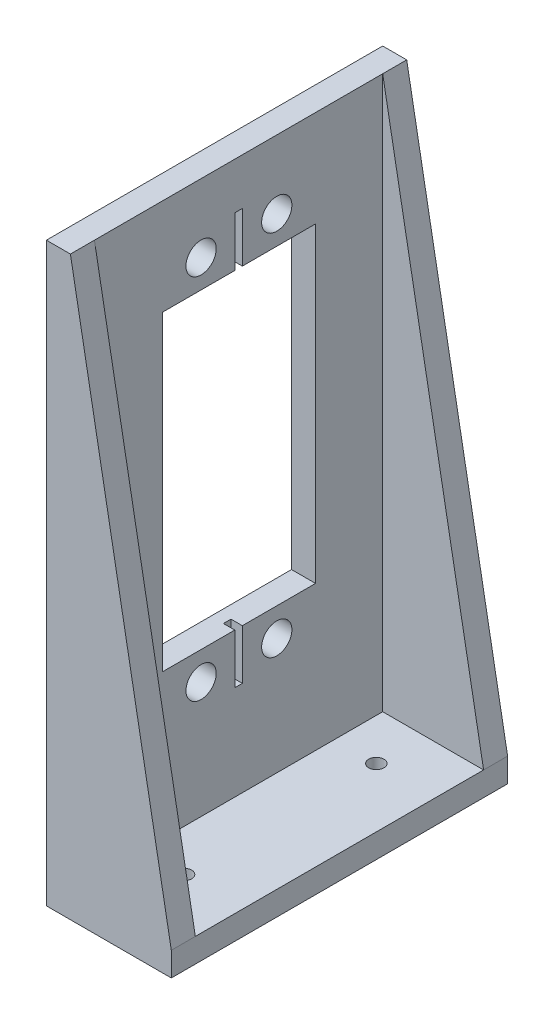
ISO-10303-21;
HEADER;
FILE_DESCRIPTION(('STEP AP214'),'2;1');
FILE_NAME('part.step','',(''),(''),'','','');
FILE_SCHEMA(('AUTOMOTIVE_DESIGN { 1 0 10303 214 1 1 1 1 }'));
ENDSEC;
DATA;
#1=APPLICATION_CONTEXT('core data for automotive mechanical design processes');
#2=APPLICATION_PROTOCOL_DEFINITION('international standard','automotive_design',2000,#1);
#3=PRODUCT_CONTEXT('',#1,'mechanical');
#4=PRODUCT('Part','Part','',(#3));
#5=PRODUCT_RELATED_PRODUCT_CATEGORY('part','',(#4));
#6=PRODUCT_DEFINITION_FORMATION('','',#4);
#7=PRODUCT_DEFINITION_CONTEXT('part definition',#1,'design');
#8=PRODUCT_DEFINITION('design','',#6,#7);
#9=PRODUCT_DEFINITION_SHAPE('','',#8);
#10=(LENGTH_UNIT() NAMED_UNIT(*) SI_UNIT(.MILLI.,.METRE.));
#11=(NAMED_UNIT(*) PLANE_ANGLE_UNIT() SI_UNIT($,.RADIAN.));
#12=(NAMED_UNIT(*) SI_UNIT($,.STERADIAN.) SOLID_ANGLE_UNIT());
#13=UNCERTAINTY_MEASURE_WITH_UNIT(LENGTH_MEASURE(1.E-05),#10,'distance_accuracy_value','');
#14=(GEOMETRIC_REPRESENTATION_CONTEXT(3) GLOBAL_UNCERTAINTY_ASSIGNED_CONTEXT((#13)) GLOBAL_UNIT_ASSIGNED_CONTEXT((#10,
#11,#12)) REPRESENTATION_CONTEXT('',''));
#15=CARTESIAN_POINT('',(0.,0.,0.));
#16=DIRECTION('',(0.,0.,1.));
#17=DIRECTION('',(1.,0.,0.));
#18=AXIS2_PLACEMENT_3D('',#15,#16,#17);
#19=CARTESIAN_POINT('',(3.175,3.175,22.225));
#20=DIRECTION('',(0.,-1.,0.));
#21=DIRECTION('',(1.,0.,0.));
#22=AXIS2_PLACEMENT_3D('',#19,#20,#21);
#23=PLANE('',#22);
#24=CARTESIAN_POINT('',(8.67999991199999,3.175,-12.7));
#25=DIRECTION('',(0.,1.,0.));
#26=DIRECTION('',(-1.,0.,0.));
#27=AXIS2_PLACEMENT_3D('',#24,#25,#26);
#28=CIRCLE('',#27,1.000000032);
#29=CARTESIAN_POINT('',(7.67999987999999,3.175,-12.7));
#30=VERTEX_POINT('',#29);
#31=EDGE_CURVE('E306',#30,#30,#28,.T.);
#32=ORIENTED_EDGE('',*,*,#31,.F.);
#33=EDGE_LOOP('',(#32));
#34=FACE_BOUND('',#33,.T.);
#35=CARTESIAN_POINT('',(8.67999991199999,3.175,12.7));
#36=DIRECTION('',(0.,1.,0.));
#37=DIRECTION('',(1.,0.,0.));
#38=AXIS2_PLACEMENT_3D('',#35,#36,#37);
#39=CIRCLE('',#38,1.000000032);
#40=CARTESIAN_POINT('',(9.679999944,3.175,12.7));
#41=VERTEX_POINT('',#40);
#42=EDGE_CURVE('E309',#41,#41,#39,.T.);
#43=ORIENTED_EDGE('',*,*,#42,.F.);
#44=EDGE_LOOP('',(#43));
#45=FACE_BOUND('',#44,.T.);
#46=DIRECTION('',(1.,0.,0.));
#47=VECTOR('',#46,1.);
#48=CARTESIAN_POINT('',(16.51,3.175,-19.05));
#49=LINE('',#48,#47);
#50=CARTESIAN_POINT('',(3.175,3.175,-19.05));
#51=VERTEX_POINT('',#50);
#52=CARTESIAN_POINT('',(16.51,3.175,-19.05));
#53=VERTEX_POINT('',#52);
#54=EDGE_CURVE('E320',#51,#53,#49,.T.);
#55=ORIENTED_EDGE('',*,*,#54,.F.);
#56=DIRECTION('',(0.,0.,-1.));
#57=VECTOR('',#56,1.);
#58=CARTESIAN_POINT('',(3.175,3.175,22.225));
#59=LINE('',#58,#57);
#60=CARTESIAN_POINT('',(3.175,3.175,19.05));
#61=VERTEX_POINT('',#60);
#62=EDGE_CURVE('E371',#61,#51,#59,.T.);
#63=ORIENTED_EDGE('',*,*,#62,.F.);
#64=DIRECTION('',(1.,0.,0.));
#65=VECTOR('',#64,1.);
#66=CARTESIAN_POINT('',(16.51,3.175,19.05));
#67=LINE('',#66,#65);
#68=CARTESIAN_POINT('',(16.51,3.175,19.05));
#69=VERTEX_POINT('',#68);
#70=EDGE_CURVE('E334',#61,#69,#67,.T.);
#71=ORIENTED_EDGE('',*,*,#70,.T.);
#72=DIRECTION('',(0.,0.,-1.));
#73=VECTOR('',#72,1.);
#74=CARTESIAN_POINT('',(16.51,3.175,22.225));
#75=LINE('',#74,#73);
#76=EDGE_CURVE('E373',#69,#53,#75,.T.);
#77=ORIENTED_EDGE('',*,*,#76,.T.);
#78=EDGE_LOOP('',(#55,#63,#71,#77));
#79=FACE_BOUND('',#78,.T.);
#80=ADVANCED_FACE('F37',(#34,#45,#79),#23,.F.);
#81=CARTESIAN_POINT('',(3.175,76.2,22.225));
#82=DIRECTION('',(-1.,0.,0.));
#83=DIRECTION('',(0.,-1.,0.));
#84=AXIS2_PLACEMENT_3D('',#81,#82,#83);
#85=PLANE('',#84);
#86=DIRECTION('',(0.,0.,-1.));
#87=VECTOR('',#86,1.);
#88=CARTESIAN_POINT('',(3.175,15.693999981,10.079999906));
#89=LINE('',#88,#87);
#90=CARTESIAN_POINT('',(3.175,15.693999981,0.500000016));
#91=VERTEX_POINT('',#90);
#92=CARTESIAN_POINT('',(3.175,15.693999981,-0.500000016));
#93=VERTEX_POINT('',#92);
#94=EDGE_CURVE('E193',#91,#93,#89,.T.);
#95=ORIENTED_EDGE('',*,*,#94,.F.);
#96=DIRECTION('',(0.,1.,0.));
#97=VECTOR('',#96,1.);
#98=CARTESIAN_POINT('',(3.175,15.693999981,0.500000016));
#99=LINE('',#98,#97);
#100=CARTESIAN_POINT('',(3.175,22.297999981,0.500000016));
#101=VERTEX_POINT('',#100);
#102=EDGE_CURVE('E176',#91,#101,#99,.T.);
#103=ORIENTED_EDGE('',*,*,#102,.T.);
#104=DIRECTION('',(0.,0.,-1.));
#105=VECTOR('',#104,1.);
#106=CARTESIAN_POINT('',(3.175,22.297999981,10.079999906));
#107=LINE('',#106,#105);
#108=CARTESIAN_POINT('',(3.175,22.297999981,10.079999906));
#109=VERTEX_POINT('',#108);
#110=EDGE_CURVE('E259',#109,#101,#107,.T.);
#111=ORIENTED_EDGE('',*,*,#110,.F.);
#112=DIRECTION('',(0.,-1.,0.));
#113=VECTOR('',#112,1.);
#114=CARTESIAN_POINT('',(3.175,63.451999969,10.079999906));
#115=LINE('',#114,#113);
#116=CARTESIAN_POINT('',(3.175,63.451999969,10.079999906));
#117=VERTEX_POINT('',#116);
#118=EDGE_CURVE('E237',#117,#109,#115,.T.);
#119=ORIENTED_EDGE('',*,*,#118,.F.);
#120=DIRECTION('',(0.,0.,1.));
#121=VECTOR('',#120,1.);
#122=CARTESIAN_POINT('',(3.175,63.451999969,10.079999906));
#123=LINE('',#122,#121);
#124=CARTESIAN_POINT('',(3.175,63.451999969,0.500000016));
#125=VERTEX_POINT('',#124);
#126=EDGE_CURVE('E264',#125,#117,#123,.T.);
#127=ORIENTED_EDGE('',*,*,#126,.F.);
#128=DIRECTION('',(0.,-1.,0.));
#129=VECTOR('',#128,1.);
#130=CARTESIAN_POINT('',(3.175,70.055999969,0.500000016));
#131=LINE('',#130,#129);
#132=CARTESIAN_POINT('',(3.175,70.055999969,0.500000016));
#133=VERTEX_POINT('',#132);
#134=EDGE_CURVE('E60',#133,#125,#131,.T.);
#135=ORIENTED_EDGE('',*,*,#134,.F.);
#136=DIRECTION('',(0.,0.,1.));
#137=VECTOR('',#136,1.);
#138=CARTESIAN_POINT('',(3.175,70.055999969,-0.500000016));
#139=LINE('',#138,#137);
#140=CARTESIAN_POINT('',(3.175,70.055999969,-0.500000016));
#141=VERTEX_POINT('',#140);
#142=EDGE_CURVE('E216',#141,#133,#139,.T.);
#143=ORIENTED_EDGE('',*,*,#142,.F.);
#144=DIRECTION('',(0.,-1.,0.));
#145=VECTOR('',#144,1.);
#146=CARTESIAN_POINT('',(3.175,70.055999969,-0.500000016));
#147=LINE('',#146,#145);
#148=CARTESIAN_POINT('',(3.175,63.451999969,-0.500000016));
#149=VERTEX_POINT('',#148);
#150=EDGE_CURVE('E234',#141,#149,#147,.T.);
#151=ORIENTED_EDGE('',*,*,#150,.T.);
#152=CARTESIAN_POINT('',(3.175,63.451999969,-10.173999972));
#153=VERTEX_POINT('',#152);
#154=EDGE_CURVE('E247',#153,#149,#123,.T.);
#155=ORIENTED_EDGE('',*,*,#154,.F.);
#156=DIRECTION('',(0.,1.,0.));
#157=VECTOR('',#156,1.);
#158=CARTESIAN_POINT('',(3.175,63.451999969,-10.173999972));
#159=LINE('',#158,#157);
#160=CARTESIAN_POINT('',(3.175,22.297999981,-10.173999972));
#161=VERTEX_POINT('',#160);
#162=EDGE_CURVE('E261',#161,#153,#159,.T.);
#163=ORIENTED_EDGE('',*,*,#162,.F.);
#164=CARTESIAN_POINT('',(3.175,22.297999981,-0.500000016));
#165=VERTEX_POINT('',#164);
#166=EDGE_CURVE('E258',#165,#161,#107,.T.);
#167=ORIENTED_EDGE('',*,*,#166,.F.);
#168=DIRECTION('',(0.,1.,0.));
#169=VECTOR('',#168,1.);
#170=CARTESIAN_POINT('',(3.175,15.693999981,-0.500000016));
#171=LINE('',#170,#169);
#172=EDGE_CURVE('E52',#93,#165,#171,.T.);
#173=ORIENTED_EDGE('',*,*,#172,.F.);
#174=EDGE_LOOP('',(#95,#103,#111,#119,#127,#135,#143,#151,#155,#163,#167,#173));
#175=FACE_BOUND('',#174,.T.);
#176=CARTESIAN_POINT('',(3.175,18.574999934,-5.047000066));
#177=DIRECTION('',(1.,0.,0.));
#178=DIRECTION('',(0.,1.,0.));
#179=AXIS2_PLACEMENT_3D('',#176,#177,#178);
#180=CIRCLE('',#179,2.000000064);
#181=CARTESIAN_POINT('',(3.175,20.574999998,-5.047000066));
#182=VERTEX_POINT('',#181);
#183=EDGE_CURVE('E284',#182,#182,#180,.T.);
#184=ORIENTED_EDGE('',*,*,#183,.F.);
#185=EDGE_LOOP('',(#184));
#186=FACE_BOUND('',#185,.T.);
#187=CARTESIAN_POINT('',(3.175,67.175000016,4.953));
#188=DIRECTION('',(1.,0.,0.));
#189=DIRECTION('',(0.,1.,0.));
#190=AXIS2_PLACEMENT_3D('',#187,#188,#189);
#191=CIRCLE('',#190,2.000000064);
#192=CARTESIAN_POINT('',(3.175,69.17500008,4.953));
#193=VERTEX_POINT('',#192);
#194=EDGE_CURVE('E291',#193,#193,#191,.T.);
#195=ORIENTED_EDGE('',*,*,#194,.F.);
#196=EDGE_LOOP('',(#195));
#197=FACE_BOUND('',#196,.T.);
#198=CARTESIAN_POINT('',(3.175,67.175000016,-5.047000066));
#199=DIRECTION('',(1.,0.,0.));
#200=DIRECTION('',(0.,1.,0.));
#201=AXIS2_PLACEMENT_3D('',#198,#199,#200);
#202=CIRCLE('',#201,2.000000064);
#203=CARTESIAN_POINT('',(3.175,69.17500008,-5.047000066));
#204=VERTEX_POINT('',#203);
#205=EDGE_CURVE('E278',#204,#204,#202,.T.);
#206=ORIENTED_EDGE('',*,*,#205,.F.);
#207=EDGE_LOOP('',(#206));
#208=FACE_BOUND('',#207,.T.);
#209=CARTESIAN_POINT('',(3.175,18.574999934,4.953));
#210=DIRECTION('',(1.,0.,0.));
#211=DIRECTION('',(0.,1.,0.));
#212=AXIS2_PLACEMENT_3D('',#209,#210,#211);
#213=CIRCLE('',#212,2.000000064);
#214=CARTESIAN_POINT('',(3.175,20.574999998,4.953));
#215=VERTEX_POINT('',#214);
#216=EDGE_CURVE('E287',#215,#215,#213,.T.);
#217=ORIENTED_EDGE('',*,*,#216,.F.);
#218=EDGE_LOOP('',(#217));
#219=FACE_BOUND('',#218,.T.);
#220=DIRECTION('',(0.,-1.,0.));
#221=VECTOR('',#220,1.);
#222=CARTESIAN_POINT('',(3.175,3.175,-19.05));
#223=LINE('',#222,#221);
#224=CARTESIAN_POINT('',(3.175,76.2,-19.05));
#225=VERTEX_POINT('',#224);
#226=EDGE_CURVE('E314',#225,#51,#223,.T.);
#227=ORIENTED_EDGE('',*,*,#226,.F.);
#228=DIRECTION('',(0.,0.,-1.));
#229=VECTOR('',#228,1.);
#230=CARTESIAN_POINT('',(3.175,76.2,22.225));
#231=LINE('',#230,#229);
#232=CARTESIAN_POINT('',(3.175,76.2,19.05));
#233=VERTEX_POINT('',#232);
#234=EDGE_CURVE('E367',#233,#225,#231,.T.);
#235=ORIENTED_EDGE('',*,*,#234,.F.);
#236=DIRECTION('',(0.,-1.,0.));
#237=VECTOR('',#236,1.);
#238=CARTESIAN_POINT('',(3.175,3.175,19.05));
#239=LINE('',#238,#237);
#240=EDGE_CURVE('E331',#233,#61,#239,.T.);
#241=ORIENTED_EDGE('',*,*,#240,.T.);
#242=ORIENTED_EDGE('',*,*,#62,.T.);
#243=EDGE_LOOP('',(#227,#235,#241,#242));
#244=FACE_BOUND('',#243,.T.);
#245=ADVANCED_FACE('F197',(#175,#186,#197,#208,#219,#244),#85,.F.);
#246=CARTESIAN_POINT('',(16.51,0.,22.225));
#247=DIRECTION('',(0.,1.,0.));
#248=DIRECTION('',(-1.,0.,0.));
#249=AXIS2_PLACEMENT_3D('',#246,#247,#248);
#250=PLANE('',#249);
#251=CARTESIAN_POINT('',(8.67999991199999,0.,-12.7));
#252=DIRECTION('',(0.,1.,0.));
#253=DIRECTION('',(-1.,0.,0.));
#254=AXIS2_PLACEMENT_3D('',#251,#252,#253);
#255=CIRCLE('',#254,1.000000032);
#256=CARTESIAN_POINT('',(7.67999987999999,0.,-12.7));
#257=VERTEX_POINT('',#256);
#258=EDGE_CURVE('E302',#257,#257,#255,.T.);
#259=ORIENTED_EDGE('',*,*,#258,.T.);
#260=EDGE_LOOP('',(#259));
#261=FACE_BOUND('',#260,.T.);
#262=CARTESIAN_POINT('',(8.67999991199999,0.,12.7));
#263=DIRECTION('',(0.,1.,0.));
#264=DIRECTION('',(1.,0.,0.));
#265=AXIS2_PLACEMENT_3D('',#262,#263,#264);
#266=CIRCLE('',#265,1.000000032);
#267=CARTESIAN_POINT('',(9.679999944,0.,12.7));
#268=VERTEX_POINT('',#267);
#269=EDGE_CURVE('E299',#268,#268,#266,.T.);
#270=ORIENTED_EDGE('',*,*,#269,.T.);
#271=EDGE_LOOP('',(#270));
#272=FACE_BOUND('',#271,.T.);
#273=DIRECTION('',(1.,0.,0.));
#274=VECTOR('',#273,1.);
#275=CARTESIAN_POINT('',(16.51,0.,-22.225));
#276=LINE('',#275,#274);
#277=CARTESIAN_POINT('',(0.,0.,-22.225));
#278=VERTEX_POINT('',#277);
#279=CARTESIAN_POINT('',(16.51,0.,-22.225));
#280=VERTEX_POINT('',#279);
#281=EDGE_CURVE('E340',#278,#280,#276,.T.);
#282=ORIENTED_EDGE('',*,*,#281,.T.);
#283=DIRECTION('',(0.,0.,-1.));
#284=VECTOR('',#283,1.);
#285=CARTESIAN_POINT('',(16.51,0.,22.225));
#286=LINE('',#285,#284);
#287=CARTESIAN_POINT('',(16.51,0.,22.225));
#288=VERTEX_POINT('',#287);
#289=EDGE_CURVE('E11',#288,#280,#286,.T.);
#290=ORIENTED_EDGE('',*,*,#289,.F.);
#291=DIRECTION('',(1.,0.,0.));
#292=VECTOR('',#291,1.);
#293=CARTESIAN_POINT('',(16.51,0.,22.225));
#294=LINE('',#293,#292);
#295=CARTESIAN_POINT('',(0.,0.,22.225));
#296=VERTEX_POINT('',#295);
#297=EDGE_CURVE('E343',#296,#288,#294,.T.);
#298=ORIENTED_EDGE('',*,*,#297,.F.);
#299=DIRECTION('',(0.,0.,-1.));
#300=VECTOR('',#299,1.);
#301=CARTESIAN_POINT('',(0.,0.,22.225));
#302=LINE('',#301,#300);
#303=EDGE_CURVE('E354',#296,#278,#302,.T.);
#304=ORIENTED_EDGE('',*,*,#303,.T.);
#305=EDGE_LOOP('',(#282,#290,#298,#304));
#306=FACE_BOUND('',#305,.T.);
#307=ADVANCED_FACE('F39',(#261,#272,#306),#250,.F.);
#308=CARTESIAN_POINT('',(16.51,3.175,22.225));
#309=DIRECTION('',(-1.,0.,0.));
#310=DIRECTION('',(0.,0.,1.));
#311=AXIS2_PLACEMENT_3D('',#308,#309,#310);
#312=PLANE('',#311);
#313=DIRECTION('',(0.,1.,0.));
#314=VECTOR('',#313,1.);
#315=CARTESIAN_POINT('',(16.51,3.175,-22.225));
#316=LINE('',#315,#314);
#317=CARTESIAN_POINT('',(16.51,3.175,-22.225));
#318=VERTEX_POINT('',#317);
#319=EDGE_CURVE('E357',#280,#318,#316,.T.);
#320=ORIENTED_EDGE('',*,*,#319,.T.);
#321=DIRECTION('',(0.,0.,-1.));
#322=VECTOR('',#321,1.);
#323=CARTESIAN_POINT('',(16.51,3.175,-19.05));
#324=LINE('',#323,#322);
#325=EDGE_CURVE('E326',#53,#318,#324,.T.);
#326=ORIENTED_EDGE('',*,*,#325,.F.);
#327=ORIENTED_EDGE('',*,*,#76,.F.);
#328=CARTESIAN_POINT('',(16.51,3.175,22.225));
#329=VERTEX_POINT('',#328);
#330=EDGE_CURVE('E45',#329,#69,#75,.T.);
#331=ORIENTED_EDGE('',*,*,#330,.F.);
#332=DIRECTION('',(0.,1.,0.));
#333=VECTOR('',#332,1.);
#334=CARTESIAN_POINT('',(16.51,3.175,22.225));
#335=LINE('',#334,#333);
#336=EDGE_CURVE('E346',#288,#329,#335,.T.);
#337=ORIENTED_EDGE('',*,*,#336,.F.);
#338=ORIENTED_EDGE('',*,*,#289,.T.);
#339=EDGE_LOOP('',(#320,#326,#327,#331,#337,#338));
#340=FACE_BOUND('',#339,.T.);
#341=ADVANCED_FACE('F431',(#340),#312,.F.);
#342=CARTESIAN_POINT('',(0.,76.2,22.225));
#343=DIRECTION('',(0.,-1.,0.));
#344=DIRECTION('',(0.,0.,-1.));
#345=AXIS2_PLACEMENT_3D('',#342,#343,#344);
#346=PLANE('',#345);
#347=DIRECTION('',(-1.,0.,0.));
#348=VECTOR('',#347,1.);
#349=CARTESIAN_POINT('',(0.,76.2,-22.225));
#350=LINE('',#349,#348);
#351=CARTESIAN_POINT('',(3.175,76.2,-22.225));
#352=VERTEX_POINT('',#351);
#353=CARTESIAN_POINT('',(0.,76.2,-22.225));
#354=VERTEX_POINT('',#353);
#355=EDGE_CURVE('E359',#352,#354,#350,.T.);
#356=ORIENTED_EDGE('',*,*,#355,.T.);
#357=DIRECTION('',(0.,0.,-1.));
#358=VECTOR('',#357,1.);
#359=CARTESIAN_POINT('',(0.,76.2,22.225));
#360=LINE('',#359,#358);
#361=CARTESIAN_POINT('',(0.,76.2,22.225));
#362=VERTEX_POINT('',#361);
#363=EDGE_CURVE('E364',#362,#354,#360,.T.);
#364=ORIENTED_EDGE('',*,*,#363,.F.);
#365=DIRECTION('',(-1.,0.,0.));
#366=VECTOR('',#365,1.);
#367=CARTESIAN_POINT('',(0.,76.2,22.225));
#368=LINE('',#367,#366);
#369=CARTESIAN_POINT('',(3.175,76.2,22.225));
#370=VERTEX_POINT('',#369);
#371=EDGE_CURVE('E350',#370,#362,#368,.T.);
#372=ORIENTED_EDGE('',*,*,#371,.F.);
#373=EDGE_CURVE('E368',#370,#233,#231,.T.);
#374=ORIENTED_EDGE('',*,*,#373,.T.);
#375=ORIENTED_EDGE('',*,*,#234,.T.);
#376=DIRECTION('',(0.,0.,-1.));
#377=VECTOR('',#376,1.);
#378=CARTESIAN_POINT('',(3.175,76.2,-19.05));
#379=LINE('',#378,#377);
#380=EDGE_CURVE('E323',#225,#352,#379,.T.);
#381=ORIENTED_EDGE('',*,*,#380,.T.);
#382=EDGE_LOOP('',(#356,#364,#372,#374,#375,#381));
#383=FACE_BOUND('',#382,.T.);
#384=ADVANCED_FACE('F392',(#383),#346,.F.);
#385=CARTESIAN_POINT('',(0.,0.,22.225));
#386=DIRECTION('',(1.,0.,0.));
#387=DIRECTION('',(0.,0.,-1.));
#388=AXIS2_PLACEMENT_3D('',#385,#386,#387);
#389=PLANE('',#388);
#390=DIRECTION('',(0.,0.,1.));
#391=VECTOR('',#390,1.);
#392=CARTESIAN_POINT('',(0.,63.451999969,10.079999906));
#393=LINE('',#392,#391);
#394=CARTESIAN_POINT('',(0.,63.451999969,-10.173999972));
#395=VERTEX_POINT('',#394);
#396=CARTESIAN_POINT('',(0.,63.451999969,10.079999906));
#397=VERTEX_POINT('',#396);
#398=EDGE_CURVE('E253',#395,#397,#393,.T.);
#399=ORIENTED_EDGE('',*,*,#398,.T.);
#400=DIRECTION('',(0.,-1.,0.));
#401=VECTOR('',#400,1.);
#402=CARTESIAN_POINT('',(0.,63.451999969,10.079999906));
#403=LINE('',#402,#401);
#404=CARTESIAN_POINT('',(0.,22.297999981,10.079999906));
#405=VERTEX_POINT('',#404);
#406=EDGE_CURVE('E243',#397,#405,#403,.T.);
#407=ORIENTED_EDGE('',*,*,#406,.T.);
#408=DIRECTION('',(0.,0.,-1.));
#409=VECTOR('',#408,1.);
#410=CARTESIAN_POINT('',(0.,22.297999981,10.079999906));
#411=LINE('',#410,#409);
#412=CARTESIAN_POINT('',(0.,22.297999981,-10.173999972));
#413=VERTEX_POINT('',#412);
#414=EDGE_CURVE('E246',#405,#413,#411,.T.);
#415=ORIENTED_EDGE('',*,*,#414,.T.);
#416=DIRECTION('',(0.,1.,0.));
#417=VECTOR('',#416,1.);
#418=CARTESIAN_POINT('',(0.,63.451999969,-10.173999972));
#419=LINE('',#418,#417);
#420=EDGE_CURVE('E250',#413,#395,#419,.T.);
#421=ORIENTED_EDGE('',*,*,#420,.T.);
#422=EDGE_LOOP('',(#399,#407,#415,#421));
#423=FACE_BOUND('',#422,.T.);
#424=CARTESIAN_POINT('',(0.,18.574999934,-5.047000066));
#425=DIRECTION('',(1.,0.,0.));
#426=DIRECTION('',(0.,1.,0.));
#427=AXIS2_PLACEMENT_3D('',#424,#425,#426);
#428=CIRCLE('',#427,2.000000064);
#429=CARTESIAN_POINT('',(0.,20.574999998,-5.047000066));
#430=VERTEX_POINT('',#429);
#431=EDGE_CURVE('E288',#430,#430,#428,.T.);
#432=ORIENTED_EDGE('',*,*,#431,.T.);
#433=EDGE_LOOP('',(#432));
#434=FACE_BOUND('',#433,.T.);
#435=CARTESIAN_POINT('',(0.,67.175000016,4.953));
#436=DIRECTION('',(1.,0.,0.));
#437=DIRECTION('',(0.,1.,0.));
#438=AXIS2_PLACEMENT_3D('',#435,#436,#437);
#439=CIRCLE('',#438,2.000000064);
#440=CARTESIAN_POINT('',(0.,69.17500008,4.953));
#441=VERTEX_POINT('',#440);
#442=EDGE_CURVE('E281',#441,#441,#439,.T.);
#443=ORIENTED_EDGE('',*,*,#442,.T.);
#444=EDGE_LOOP('',(#443));
#445=FACE_BOUND('',#444,.T.);
#446=CARTESIAN_POINT('',(0.,67.175000016,-5.047000066));
#447=DIRECTION('',(1.,0.,0.));
#448=DIRECTION('',(0.,1.,0.));
#449=AXIS2_PLACEMENT_3D('',#446,#447,#448);
#450=CIRCLE('',#449,2.000000064);
#451=CARTESIAN_POINT('',(0.,69.17500008,-5.047000066));
#452=VERTEX_POINT('',#451);
#453=EDGE_CURVE('E270',#452,#452,#450,.T.);
#454=ORIENTED_EDGE('',*,*,#453,.T.);
#455=EDGE_LOOP('',(#454));
#456=FACE_BOUND('',#455,.T.);
#457=CARTESIAN_POINT('',(0.,18.574999934,4.953));
#458=DIRECTION('',(1.,0.,0.));
#459=DIRECTION('',(0.,1.,0.));
#460=AXIS2_PLACEMENT_3D('',#457,#458,#459);
#461=CIRCLE('',#460,2.000000064);
#462=CARTESIAN_POINT('',(0.,20.574999998,4.953));
#463=VERTEX_POINT('',#462);
#464=EDGE_CURVE('E296',#463,#463,#461,.T.);
#465=ORIENTED_EDGE('',*,*,#464,.T.);
#466=EDGE_LOOP('',(#465));
#467=FACE_BOUND('',#466,.T.);
#468=DIRECTION('',(0.,-1.,0.));
#469=VECTOR('',#468,1.);
#470=CARTESIAN_POINT('',(0.,0.,-22.225));
#471=LINE('',#470,#469);
#472=EDGE_CURVE('E347',#354,#278,#471,.T.);
#473=ORIENTED_EDGE('',*,*,#472,.T.);
#474=ORIENTED_EDGE('',*,*,#303,.F.);
#475=DIRECTION('',(0.,-1.,0.));
#476=VECTOR('',#475,1.);
#477=CARTESIAN_POINT('',(0.,0.,22.225));
#478=LINE('',#477,#476);
#479=EDGE_CURVE('E352',#362,#296,#478,.T.);
#480=ORIENTED_EDGE('',*,*,#479,.F.);
#481=ORIENTED_EDGE('',*,*,#363,.T.);
#482=EDGE_LOOP('',(#473,#474,#480,#481));
#483=FACE_BOUND('',#482,.T.);
#484=ADVANCED_FACE('F401',(#423,#434,#445,#456,#467,#483),#389,.F.);
#485=CARTESIAN_POINT('',(0.,0.,22.225));
#486=DIRECTION('',(0.,0.,-1.));
#487=DIRECTION('',(-1.,0.,0.));
#488=AXIS2_PLACEMENT_3D('',#485,#486,#487);
#489=PLANE('',#488);
#490=DIRECTION('',(-0.179638155253197,0.983732754957986,0.));
#491=VECTOR('',#490,1.);
#492=CARTESIAN_POINT('',(3.175,76.2,22.225));
#493=LINE('',#492,#491);
#494=EDGE_CURVE('E329',#329,#370,#493,.T.);
#495=ORIENTED_EDGE('',*,*,#494,.T.);
#496=ORIENTED_EDGE('',*,*,#371,.T.);
#497=ORIENTED_EDGE('',*,*,#479,.T.);
#498=ORIENTED_EDGE('',*,*,#297,.T.);
#499=ORIENTED_EDGE('',*,*,#336,.T.);
#500=EDGE_LOOP('',(#495,#496,#497,#498,#499));
#501=FACE_BOUND('',#500,.T.);
#502=ADVANCED_FACE('F407',(#501),#489,.F.);
#503=CARTESIAN_POINT('',(0.,0.,-22.225));
#504=DIRECTION('',(0.,0.,-1.));
#505=DIRECTION('',(-1.,0.,0.));
#506=AXIS2_PLACEMENT_3D('',#503,#504,#505);
#507=PLANE('',#506);
#508=ORIENTED_EDGE('',*,*,#355,.F.);
#509=DIRECTION('',(-0.179638155253197,0.983732754957986,0.));
#510=VECTOR('',#509,1.);
#511=CARTESIAN_POINT('',(3.175,76.2,-22.225));
#512=LINE('',#511,#510);
#513=EDGE_CURVE('E305',#318,#352,#512,.T.);
#514=ORIENTED_EDGE('',*,*,#513,.F.);
#515=ORIENTED_EDGE('',*,*,#319,.F.);
#516=ORIENTED_EDGE('',*,*,#281,.F.);
#517=ORIENTED_EDGE('',*,*,#472,.F.);
#518=EDGE_LOOP('',(#508,#514,#515,#516,#517));
#519=FACE_BOUND('',#518,.T.);
#520=ADVANCED_FACE('F397',(#519),#507,.T.);
#521=CARTESIAN_POINT('',(3.175,76.2,19.05));
#522=DIRECTION('',(0.983732754957986,0.179638155253197,0.));
#523=DIRECTION('',(-0.179638155253197,0.983732754957986,0.));
#524=AXIS2_PLACEMENT_3D('',#521,#522,#523);
#525=PLANE('',#524);
#526=ORIENTED_EDGE('',*,*,#494,.F.);
#527=ORIENTED_EDGE('',*,*,#330,.T.);
#528=DIRECTION('',(-0.179638155253197,0.983732754957986,0.));
#529=VECTOR('',#528,1.);
#530=CARTESIAN_POINT('',(3.175,76.2,19.05));
#531=LINE('',#530,#529);
#532=EDGE_CURVE('E337',#69,#233,#531,.T.);
#533=ORIENTED_EDGE('',*,*,#532,.T.);
#534=ORIENTED_EDGE('',*,*,#373,.F.);
#535=EDGE_LOOP('',(#526,#527,#533,#534));
#536=FACE_BOUND('',#535,.T.);
#537=ADVANCED_FACE('F409',(#536),#525,.T.);
#538=CARTESIAN_POINT('',(0.,0.,19.05));
#539=DIRECTION('',(0.,0.,1.));
#540=DIRECTION('',(1.,0.,0.));
#541=AXIS2_PLACEMENT_3D('',#538,#539,#540);
#542=PLANE('',#541);
#543=ORIENTED_EDGE('',*,*,#240,.F.);
#544=ORIENTED_EDGE('',*,*,#532,.F.);
#545=ORIENTED_EDGE('',*,*,#70,.F.);
#546=EDGE_LOOP('',(#543,#544,#545));
#547=FACE_BOUND('',#546,.T.);
#548=ADVANCED_FACE('F412',(#547),#542,.F.);
#549=CARTESIAN_POINT('',(3.175,76.2,-19.05));
#550=DIRECTION('',(-0.983732754957986,-0.179638155253197,0.));
#551=DIRECTION('',(0.179638155253197,-0.983732754957986,0.));
#552=AXIS2_PLACEMENT_3D('',#549,#550,#551);
#553=PLANE('',#552);
#554=ORIENTED_EDGE('',*,*,#513,.T.);
#555=ORIENTED_EDGE('',*,*,#380,.F.);
#556=DIRECTION('',(-0.179638155253197,0.983732754957986,0.));
#557=VECTOR('',#556,1.);
#558=CARTESIAN_POINT('',(3.175,76.2,-19.05));
#559=LINE('',#558,#557);
#560=EDGE_CURVE('E317',#53,#225,#559,.T.);
#561=ORIENTED_EDGE('',*,*,#560,.F.);
#562=ORIENTED_EDGE('',*,*,#325,.T.);
#563=EDGE_LOOP('',(#554,#555,#561,#562));
#564=FACE_BOUND('',#563,.T.);
#565=ADVANCED_FACE('F387',(#564),#553,.F.);
#566=CARTESIAN_POINT('',(0.,0.,-19.05));
#567=DIRECTION('',(0.,0.,-1.));
#568=DIRECTION('',(1.,0.,0.));
#569=AXIS2_PLACEMENT_3D('',#566,#567,#568);
#570=PLANE('',#569);
#571=ORIENTED_EDGE('',*,*,#226,.T.);
#572=ORIENTED_EDGE('',*,*,#54,.T.);
#573=ORIENTED_EDGE('',*,*,#560,.T.);
#574=EDGE_LOOP('',(#571,#572,#573));
#575=FACE_BOUND('',#574,.T.);
#576=ADVANCED_FACE('F384',(#575),#570,.F.);
#577=CARTESIAN_POINT('',(8.67999991199999,0.,12.7));
#578=DIRECTION('',(0.,1.,0.));
#579=DIRECTION('',(-1.,0.,0.));
#580=AXIS2_PLACEMENT_3D('',#577,#578,#579);
#581=CYLINDRICAL_SURFACE('',#580,1.000000032);
#582=ORIENTED_EDGE('',*,*,#269,.F.);
#583=EDGE_LOOP('',(#582));
#584=FACE_BOUND('',#583,.T.);
#585=ORIENTED_EDGE('',*,*,#42,.T.);
#586=EDGE_LOOP('',(#585));
#587=FACE_BOUND('',#586,.T.);
#588=ADVANCED_FACE('F444',(#584,#587),#581,.F.);
#589=CARTESIAN_POINT('',(8.67999991199999,0.,-12.7));
#590=DIRECTION('',(0.,1.,0.));
#591=DIRECTION('',(-1.,0.,0.));
#592=AXIS2_PLACEMENT_3D('',#589,#590,#591);
#593=CYLINDRICAL_SURFACE('',#592,1.000000032);
#594=ORIENTED_EDGE('',*,*,#258,.F.);
#595=EDGE_LOOP('',(#594));
#596=FACE_BOUND('',#595,.T.);
#597=ORIENTED_EDGE('',*,*,#31,.T.);
#598=EDGE_LOOP('',(#597));
#599=FACE_BOUND('',#598,.T.);
#600=ADVANCED_FACE('F447',(#596,#599),#593,.F.);
#601=CARTESIAN_POINT('',(0.,18.574999934,4.953));
#602=DIRECTION('',(1.,0.,0.));
#603=DIRECTION('',(0.,1.,0.));
#604=AXIS2_PLACEMENT_3D('',#601,#602,#603);
#605=CYLINDRICAL_SURFACE('',#604,2.000000064);
#606=ORIENTED_EDGE('',*,*,#464,.F.);
#607=EDGE_LOOP('',(#606));
#608=FACE_BOUND('',#607,.T.);
#609=ORIENTED_EDGE('',*,*,#216,.T.);
#610=EDGE_LOOP('',(#609));
#611=FACE_BOUND('',#610,.T.);
#612=ADVANCED_FACE('F454',(#608,#611),#605,.F.);
#613=CARTESIAN_POINT('',(0.,67.175000016,-5.047000066));
#614=DIRECTION('',(1.,0.,0.));
#615=DIRECTION('',(0.,1.,0.));
#616=AXIS2_PLACEMENT_3D('',#613,#614,#615);
#617=CYLINDRICAL_SURFACE('',#616,2.000000064);
#618=ORIENTED_EDGE('',*,*,#453,.F.);
#619=EDGE_LOOP('',(#618));
#620=FACE_BOUND('',#619,.T.);
#621=ORIENTED_EDGE('',*,*,#205,.T.);
#622=EDGE_LOOP('',(#621));
#623=FACE_BOUND('',#622,.T.);
#624=ADVANCED_FACE('F461',(#620,#623),#617,.F.);
#625=CARTESIAN_POINT('',(0.,67.175000016,4.953));
#626=DIRECTION('',(1.,0.,0.));
#627=DIRECTION('',(0.,1.,0.));
#628=AXIS2_PLACEMENT_3D('',#625,#626,#627);
#629=CYLINDRICAL_SURFACE('',#628,2.000000064);
#630=ORIENTED_EDGE('',*,*,#442,.F.);
#631=EDGE_LOOP('',(#630));
#632=FACE_BOUND('',#631,.T.);
#633=ORIENTED_EDGE('',*,*,#194,.T.);
#634=EDGE_LOOP('',(#633));
#635=FACE_BOUND('',#634,.T.);
#636=ADVANCED_FACE('F463',(#632,#635),#629,.F.);
#637=CARTESIAN_POINT('',(0.,18.574999934,-5.047000066));
#638=DIRECTION('',(1.,0.,0.));
#639=DIRECTION('',(0.,1.,0.));
#640=AXIS2_PLACEMENT_3D('',#637,#638,#639);
#641=CYLINDRICAL_SURFACE('',#640,2.000000064);
#642=ORIENTED_EDGE('',*,*,#431,.F.);
#643=EDGE_LOOP('',(#642));
#644=FACE_BOUND('',#643,.T.);
#645=ORIENTED_EDGE('',*,*,#183,.T.);
#646=EDGE_LOOP('',(#645));
#647=FACE_BOUND('',#646,.T.);
#648=ADVANCED_FACE('F466',(#644,#647),#641,.F.);
#649=CARTESIAN_POINT('',(0.,63.451999969,10.079999906));
#650=DIRECTION('',(0.,0.,1.));
#651=DIRECTION('',(0.,-1.,0.));
#652=AXIS2_PLACEMENT_3D('',#649,#650,#651);
#653=PLANE('',#652);
#654=ORIENTED_EDGE('',*,*,#118,.T.);
#655=DIRECTION('',(1.,0.,0.));
#656=VECTOR('',#655,1.);
#657=CARTESIAN_POINT('',(0.,22.297999981,10.079999906));
#658=LINE('',#657,#656);
#659=EDGE_CURVE('E256',#405,#109,#658,.T.);
#660=ORIENTED_EDGE('',*,*,#659,.F.);
#661=ORIENTED_EDGE('',*,*,#406,.F.);
#662=DIRECTION('',(1.,0.,0.));
#663=VECTOR('',#662,1.);
#664=CARTESIAN_POINT('',(0.,63.451999969,10.079999906));
#665=LINE('',#664,#663);
#666=EDGE_CURVE('E267',#397,#117,#665,.T.);
#667=ORIENTED_EDGE('',*,*,#666,.T.);
#668=EDGE_LOOP('',(#654,#660,#661,#667));
#669=FACE_BOUND('',#668,.T.);
#670=ADVANCED_FACE('F470',(#669),#653,.F.);
#671=CARTESIAN_POINT('',(0.,63.451999969,10.079999906));
#672=DIRECTION('',(0.,1.,0.));
#673=DIRECTION('',(-1.,0.,0.));
#674=AXIS2_PLACEMENT_3D('',#671,#672,#673);
#675=PLANE('',#674);
#676=ORIENTED_EDGE('',*,*,#154,.T.);
#677=DIRECTION('',(1.,0.,0.));
#678=VECTOR('',#677,1.);
#679=CARTESIAN_POINT('',(1.674999952,63.451999969,-0.500000016));
#680=LINE('',#679,#678);
#681=CARTESIAN_POINT('',(1.674999952,63.451999969,-0.500000016));
#682=VERTEX_POINT('',#681);
#683=EDGE_CURVE('E220',#682,#149,#680,.T.);
#684=ORIENTED_EDGE('',*,*,#683,.F.);
#685=DIRECTION('',(0.,0.,-1.));
#686=VECTOR('',#685,1.);
#687=CARTESIAN_POINT('',(1.674999952,63.451999969,-0.500000016));
#688=LINE('',#687,#686);
#689=CARTESIAN_POINT('',(1.674999952,63.451999969,0.500000016));
#690=VERTEX_POINT('',#689);
#691=EDGE_CURVE('E230',#690,#682,#688,.T.);
#692=ORIENTED_EDGE('',*,*,#691,.F.);
#693=DIRECTION('',(-1.,0.,0.));
#694=VECTOR('',#693,1.);
#695=CARTESIAN_POINT('',(1.674999952,63.451999969,0.500000016));
#696=LINE('',#695,#694);
#697=EDGE_CURVE('E212',#125,#690,#696,.T.);
#698=ORIENTED_EDGE('',*,*,#697,.F.);
#699=ORIENTED_EDGE('',*,*,#126,.T.);
#700=ORIENTED_EDGE('',*,*,#666,.F.);
#701=ORIENTED_EDGE('',*,*,#398,.F.);
#702=DIRECTION('',(1.,0.,0.));
#703=VECTOR('',#702,1.);
#704=CARTESIAN_POINT('',(0.,63.451999969,-10.173999972));
#705=LINE('',#704,#703);
#706=EDGE_CURVE('E271',#395,#153,#705,.T.);
#707=ORIENTED_EDGE('',*,*,#706,.T.);
#708=EDGE_LOOP('',(#676,#684,#692,#698,#699,#700,#701,#707));
#709=FACE_BOUND('',#708,.T.);
#710=ADVANCED_FACE('F477',(#709),#675,.F.);
#711=CARTESIAN_POINT('',(0.,63.451999969,-10.173999972));
#712=DIRECTION('',(0.,0.,-1.));
#713=DIRECTION('',(0.,1.,0.));
#714=AXIS2_PLACEMENT_3D('',#711,#712,#713);
#715=PLANE('',#714);
#716=ORIENTED_EDGE('',*,*,#162,.T.);
#717=ORIENTED_EDGE('',*,*,#706,.F.);
#718=ORIENTED_EDGE('',*,*,#420,.F.);
#719=DIRECTION('',(1.,0.,0.));
#720=VECTOR('',#719,1.);
#721=CARTESIAN_POINT('',(0.,22.297999981,-10.173999972));
#722=LINE('',#721,#720);
#723=EDGE_CURVE('E273',#413,#161,#722,.T.);
#724=ORIENTED_EDGE('',*,*,#723,.T.);
#725=EDGE_LOOP('',(#716,#717,#718,#724));
#726=FACE_BOUND('',#725,.T.);
#727=ADVANCED_FACE('F483',(#726),#715,.F.);
#728=CARTESIAN_POINT('',(0.,22.297999981,10.079999906));
#729=DIRECTION('',(0.,-1.,0.));
#730=DIRECTION('',(1.,0.,0.));
#731=AXIS2_PLACEMENT_3D('',#728,#729,#730);
#732=PLANE('',#731);
#733=ORIENTED_EDGE('',*,*,#110,.T.);
#734=DIRECTION('',(1.,0.,0.));
#735=VECTOR('',#734,1.);
#736=CARTESIAN_POINT('',(0.,22.297999981,0.500000016));
#737=LINE('',#736,#735);
#738=CARTESIAN_POINT('',(1.674999952,22.297999981,0.500000016));
#739=VERTEX_POINT('',#738);
#740=EDGE_CURVE('E182',#739,#101,#737,.T.);
#741=ORIENTED_EDGE('',*,*,#740,.F.);
#742=DIRECTION('',(0.,0.,1.));
#743=VECTOR('',#742,1.);
#744=CARTESIAN_POINT('',(1.674999952,22.297999981,10.079999906));
#745=LINE('',#744,#743);
#746=CARTESIAN_POINT('',(1.674999952,22.297999981,-0.500000016));
#747=VERTEX_POINT('',#746);
#748=EDGE_CURVE('E195',#747,#739,#745,.T.);
#749=ORIENTED_EDGE('',*,*,#748,.F.);
#750=DIRECTION('',(-1.,0.,0.));
#751=VECTOR('',#750,1.);
#752=CARTESIAN_POINT('',(0.,22.297999981,-0.500000016));
#753=LINE('',#752,#751);
#754=EDGE_CURVE('E206',#165,#747,#753,.T.);
#755=ORIENTED_EDGE('',*,*,#754,.F.);
#756=ORIENTED_EDGE('',*,*,#166,.T.);
#757=ORIENTED_EDGE('',*,*,#723,.F.);
#758=ORIENTED_EDGE('',*,*,#414,.F.);
#759=ORIENTED_EDGE('',*,*,#659,.T.);
#760=EDGE_LOOP('',(#733,#741,#749,#755,#756,#757,#758,#759));
#761=FACE_BOUND('',#760,.T.);
#762=ADVANCED_FACE('F479',(#761),#732,.F.);
#763=CARTESIAN_POINT('',(1.674999952,70.055999969,-0.500000016));
#764=DIRECTION('',(0.,0.,-1.));
#765=DIRECTION('',(-1.,0.,0.));
#766=AXIS2_PLACEMENT_3D('',#763,#764,#765);
#767=PLANE('',#766);
#768=ORIENTED_EDGE('',*,*,#683,.T.);
#769=ORIENTED_EDGE('',*,*,#150,.F.);
#770=DIRECTION('',(1.,0.,0.));
#771=VECTOR('',#770,1.);
#772=CARTESIAN_POINT('',(1.674999952,70.055999969,-0.500000016));
#773=LINE('',#772,#771);
#774=CARTESIAN_POINT('',(1.674999952,70.055999969,-0.500000016));
#775=VERTEX_POINT('',#774);
#776=EDGE_CURVE('E226',#775,#141,#773,.T.);
#777=ORIENTED_EDGE('',*,*,#776,.F.);
#778=DIRECTION('',(0.,-1.,0.));
#779=VECTOR('',#778,1.);
#780=CARTESIAN_POINT('',(1.674999952,70.055999969,-0.500000016));
#781=LINE('',#780,#779);
#782=EDGE_CURVE('E238',#775,#682,#781,.T.);
#783=ORIENTED_EDGE('',*,*,#782,.T.);
#784=EDGE_LOOP('',(#768,#769,#777,#783));
#785=FACE_BOUND('',#784,.T.);
#786=ADVANCED_FACE('F482',(#785),#767,.F.);
#787=CARTESIAN_POINT('',(1.674999952,70.055999969,-0.500000016));
#788=DIRECTION('',(-1.,0.,0.));
#789=DIRECTION('',(0.,-1.,0.));
#790=AXIS2_PLACEMENT_3D('',#787,#788,#789);
#791=PLANE('',#790);
#792=ORIENTED_EDGE('',*,*,#691,.T.);
#793=ORIENTED_EDGE('',*,*,#782,.F.);
#794=DIRECTION('',(0.,0.,-1.));
#795=VECTOR('',#794,1.);
#796=CARTESIAN_POINT('',(1.674999952,70.055999969,-0.500000016));
#797=LINE('',#796,#795);
#798=CARTESIAN_POINT('',(1.674999952,70.055999969,0.500000016));
#799=VERTEX_POINT('',#798);
#800=EDGE_CURVE('E223',#799,#775,#797,.T.);
#801=ORIENTED_EDGE('',*,*,#800,.F.);
#802=DIRECTION('',(0.,-1.,0.));
#803=VECTOR('',#802,1.);
#804=CARTESIAN_POINT('',(1.674999952,70.055999969,0.500000016));
#805=LINE('',#804,#803);
#806=EDGE_CURVE('E240',#799,#690,#805,.T.);
#807=ORIENTED_EDGE('',*,*,#806,.T.);
#808=EDGE_LOOP('',(#792,#793,#801,#807));
#809=FACE_BOUND('',#808,.T.);
#810=ADVANCED_FACE('F495',(#809),#791,.F.);
#811=CARTESIAN_POINT('',(1.674999952,70.055999969,0.500000016));
#812=DIRECTION('',(0.,0.,1.));
#813=DIRECTION('',(1.,0.,0.));
#814=AXIS2_PLACEMENT_3D('',#811,#812,#813);
#815=PLANE('',#814);
#816=ORIENTED_EDGE('',*,*,#697,.T.);
#817=ORIENTED_EDGE('',*,*,#806,.F.);
#818=DIRECTION('',(-1.,0.,0.));
#819=VECTOR('',#818,1.);
#820=CARTESIAN_POINT('',(1.674999952,70.055999969,0.500000016));
#821=LINE('',#820,#819);
#822=EDGE_CURVE('E219',#133,#799,#821,.T.);
#823=ORIENTED_EDGE('',*,*,#822,.F.);
#824=ORIENTED_EDGE('',*,*,#134,.T.);
#825=EDGE_LOOP('',(#816,#817,#823,#824));
#826=FACE_BOUND('',#825,.T.);
#827=ADVANCED_FACE('F491',(#826),#815,.F.);
#828=CARTESIAN_POINT('',(0.,70.055999969,0.));
#829=DIRECTION('',(0.,1.,0.));
#830=DIRECTION('',(0.,0.,1.));
#831=AXIS2_PLACEMENT_3D('',#828,#829,#830);
#832=PLANE('',#831);
#833=ORIENTED_EDGE('',*,*,#142,.T.);
#834=ORIENTED_EDGE('',*,*,#822,.T.);
#835=ORIENTED_EDGE('',*,*,#800,.T.);
#836=ORIENTED_EDGE('',*,*,#776,.T.);
#837=EDGE_LOOP('',(#833,#834,#835,#836));
#838=FACE_BOUND('',#837,.T.);
#839=ADVANCED_FACE('F494',(#838),#832,.F.);
#840=CARTESIAN_POINT('',(0.,15.693999981,0.500000016));
#841=DIRECTION('',(0.,0.,1.));
#842=DIRECTION('',(1.,0.,0.));
#843=AXIS2_PLACEMENT_3D('',#840,#841,#842);
#844=PLANE('',#843);
#845=ORIENTED_EDGE('',*,*,#740,.T.);
#846=ORIENTED_EDGE('',*,*,#102,.F.);
#847=DIRECTION('',(1.,0.,0.));
#848=VECTOR('',#847,1.);
#849=CARTESIAN_POINT('',(0.,15.693999981,0.500000016));
#850=LINE('',#849,#848);
#851=CARTESIAN_POINT('',(1.674999952,15.693999981,0.500000016));
#852=VERTEX_POINT('',#851);
#853=EDGE_CURVE('E179',#852,#91,#850,.T.);
#854=ORIENTED_EDGE('',*,*,#853,.F.);
#855=DIRECTION('',(0.,1.,0.));
#856=VECTOR('',#855,1.);
#857=CARTESIAN_POINT('',(1.674999952,15.693999981,0.500000016));
#858=LINE('',#857,#856);
#859=EDGE_CURVE('E210',#852,#739,#858,.T.);
#860=ORIENTED_EDGE('',*,*,#859,.T.);
#861=EDGE_LOOP('',(#845,#846,#854,#860));
#862=FACE_BOUND('',#861,.T.);
#863=ADVANCED_FACE('F178',(#862),#844,.F.);
#864=CARTESIAN_POINT('',(1.674999952,15.693999981,10.079999906));
#865=DIRECTION('',(-1.,0.,0.));
#866=DIRECTION('',(0.,-1.,0.));
#867=AXIS2_PLACEMENT_3D('',#864,#865,#866);
#868=PLANE('',#867);
#869=ORIENTED_EDGE('',*,*,#748,.T.);
#870=ORIENTED_EDGE('',*,*,#859,.F.);
#871=DIRECTION('',(0.,0.,1.));
#872=VECTOR('',#871,1.);
#873=CARTESIAN_POINT('',(1.674999952,15.693999981,10.079999906));
#874=LINE('',#873,#872);
#875=CARTESIAN_POINT('',(1.674999952,15.693999981,-0.500000016));
#876=VERTEX_POINT('',#875);
#877=EDGE_CURVE('E187',#876,#852,#874,.T.);
#878=ORIENTED_EDGE('',*,*,#877,.F.);
#879=DIRECTION('',(0.,1.,0.));
#880=VECTOR('',#879,1.);
#881=CARTESIAN_POINT('',(1.674999952,15.693999981,-0.500000016));
#882=LINE('',#881,#880);
#883=EDGE_CURVE('E213',#876,#747,#882,.T.);
#884=ORIENTED_EDGE('',*,*,#883,.T.);
#885=EDGE_LOOP('',(#869,#870,#878,#884));
#886=FACE_BOUND('',#885,.T.);
#887=ADVANCED_FACE('F507',(#886),#868,.F.);
#888=CARTESIAN_POINT('',(0.,15.693999981,-0.500000016));
#889=DIRECTION('',(0.,0.,-1.));
#890=DIRECTION('',(-1.,0.,0.));
#891=AXIS2_PLACEMENT_3D('',#888,#889,#890);
#892=PLANE('',#891);
#893=ORIENTED_EDGE('',*,*,#754,.T.);
#894=ORIENTED_EDGE('',*,*,#883,.F.);
#895=DIRECTION('',(-1.,0.,0.));
#896=VECTOR('',#895,1.);
#897=CARTESIAN_POINT('',(0.,15.693999981,-0.500000016));
#898=LINE('',#897,#896);
#899=EDGE_CURVE('E200',#93,#876,#898,.T.);
#900=ORIENTED_EDGE('',*,*,#899,.F.);
#901=ORIENTED_EDGE('',*,*,#172,.T.);
#902=EDGE_LOOP('',(#893,#894,#900,#901));
#903=FACE_BOUND('',#902,.T.);
#904=ADVANCED_FACE('F508',(#903),#892,.F.);
#905=CARTESIAN_POINT('',(0.,15.693999981,0.));
#906=DIRECTION('',(0.,1.,0.));
#907=DIRECTION('',(-1.,0.,0.));
#908=AXIS2_PLACEMENT_3D('',#905,#906,#907);
#909=PLANE('',#908);
#910=ORIENTED_EDGE('',*,*,#853,.T.);
#911=ORIENTED_EDGE('',*,*,#94,.T.);
#912=ORIENTED_EDGE('',*,*,#899,.T.);
#913=ORIENTED_EDGE('',*,*,#877,.T.);
#914=EDGE_LOOP('',(#910,#911,#912,#913));
#915=FACE_BOUND('',#914,.T.);
#916=ADVANCED_FACE('F191',(#915),#909,.T.);
#917=CLOSED_SHELL('',(#80,#245,#307,#341,#384,#484,#502,#520,#537,#548,#565,#576,#588,#600,#612,
#624,#636,#648,#670,#710,#727,#762,#786,#810,#827,#839,#863,#887,#904,#916));
#918=MANIFOLD_SOLID_BREP('B2',#917);
#919=ADVANCED_BREP_SHAPE_REPRESENTATION('',(#18,#918),#14);
#920=SHAPE_DEFINITION_REPRESENTATION(#9,#919);
ENDSEC;
END-ISO-10303-21;
